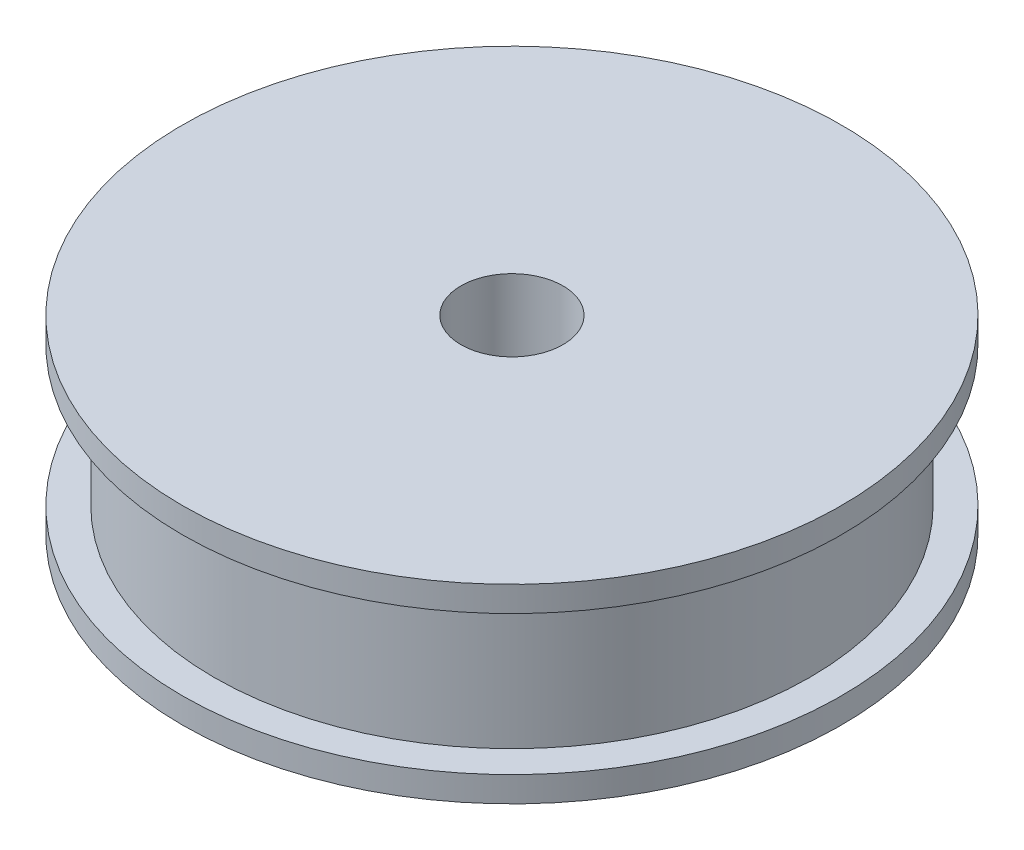
ISO-10303-21;
HEADER;
FILE_DESCRIPTION(('STEP AP214'),'2;1');
FILE_NAME('part.step','',(''),(''),'','','');
FILE_SCHEMA(('AUTOMOTIVE_DESIGN { 1 0 10303 214 1 1 1 1 }'));
ENDSEC;
DATA;
#1=APPLICATION_CONTEXT('core data for automotive mechanical design processes');
#2=APPLICATION_PROTOCOL_DEFINITION('international standard','automotive_design',2000,#1);
#3=PRODUCT_CONTEXT('',#1,'mechanical');
#4=PRODUCT('Part','Part','',(#3));
#5=PRODUCT_RELATED_PRODUCT_CATEGORY('part','',(#4));
#6=PRODUCT_DEFINITION_FORMATION('','',#4);
#7=PRODUCT_DEFINITION_CONTEXT('part definition',#1,'design');
#8=PRODUCT_DEFINITION('design','',#6,#7);
#9=PRODUCT_DEFINITION_SHAPE('','',#8);
#10=(LENGTH_UNIT() NAMED_UNIT(*) SI_UNIT(.MILLI.,.METRE.));
#11=(NAMED_UNIT(*) PLANE_ANGLE_UNIT() SI_UNIT($,.RADIAN.));
#12=(NAMED_UNIT(*) SI_UNIT($,.STERADIAN.) SOLID_ANGLE_UNIT());
#13=UNCERTAINTY_MEASURE_WITH_UNIT(LENGTH_MEASURE(1.E-05),#10,'distance_accuracy_value','');
#14=(GEOMETRIC_REPRESENTATION_CONTEXT(3) GLOBAL_UNCERTAINTY_ASSIGNED_CONTEXT((#13)) GLOBAL_UNIT_ASSIGNED_CONTEXT((#10,
#11,#12)) REPRESENTATION_CONTEXT('',''));
#15=CARTESIAN_POINT('',(0.,0.,0.));
#16=DIRECTION('',(0.,0.,1.));
#17=DIRECTION('',(1.,0.,0.));
#18=AXIS2_PLACEMENT_3D('',#15,#16,#17);
#19=CARTESIAN_POINT('',(0.,2.,0.));
#20=DIRECTION('',(0.,-1.,0.));
#21=DIRECTION('',(0.,0.,-1.));
#22=AXIS2_PLACEMENT_3D('',#19,#20,#21);
#23=CYLINDRICAL_SURFACE('',#22,26.);
#24=CARTESIAN_POINT('',(0.,2.,0.));
#25=DIRECTION('',(0.,1.,0.));
#26=DIRECTION('',(0.,0.,1.));
#27=AXIS2_PLACEMENT_3D('',#24,#25,#26);
#28=CIRCLE('',#27,26.);
#29=CARTESIAN_POINT('',(0.,2.,26.));
#30=VERTEX_POINT('',#29);
#31=EDGE_CURVE('E47',#30,#30,#28,.T.);
#32=ORIENTED_EDGE('',*,*,#31,.F.);
#33=EDGE_LOOP('',(#32));
#34=FACE_BOUND('',#33,.T.);
#35=CARTESIAN_POINT('',(0.,0.,0.));
#36=DIRECTION('',(0.,1.,0.));
#37=DIRECTION('',(0.,0.,1.));
#38=AXIS2_PLACEMENT_3D('',#35,#36,#37);
#39=CIRCLE('',#38,26.);
#40=CARTESIAN_POINT('',(0.,0.,26.));
#41=VERTEX_POINT('',#40);
#42=EDGE_CURVE('E42',#41,#41,#39,.T.);
#43=ORIENTED_EDGE('',*,*,#42,.T.);
#44=EDGE_LOOP('',(#43));
#45=FACE_BOUND('',#44,.T.);
#46=ADVANCED_FACE('F39',(#34,#45),#23,.T.);
#47=CARTESIAN_POINT('',(0.,2.,0.));
#48=DIRECTION('',(0.,1.,0.));
#49=DIRECTION('',(0.,0.,1.));
#50=AXIS2_PLACEMENT_3D('',#47,#48,#49);
#51=PLANE('',#50);
#52=CARTESIAN_POINT('',(0.,2.,0.));
#53=DIRECTION('',(0.,1.,0.));
#54=DIRECTION('',(0.,0.,1.));
#55=AXIS2_PLACEMENT_3D('',#52,#53,#54);
#56=CIRCLE('',#55,23.495);
#57=CARTESIAN_POINT('',(0.,2.,23.495));
#58=VERTEX_POINT('',#57);
#59=EDGE_CURVE('E10',#58,#58,#56,.T.);
#60=ORIENTED_EDGE('',*,*,#59,.F.);
#61=EDGE_LOOP('',(#60));
#62=FACE_BOUND('',#61,.T.);
#63=ORIENTED_EDGE('',*,*,#31,.T.);
#64=EDGE_LOOP('',(#63));
#65=FACE_BOUND('',#64,.T.);
#66=ADVANCED_FACE('F104',(#62,#65),#51,.T.);
#67=CARTESIAN_POINT('',(0.,0.,0.));
#68=DIRECTION('',(0.,1.,0.));
#69=DIRECTION('',(0.,0.,1.));
#70=AXIS2_PLACEMENT_3D('',#67,#68,#69);
#71=PLANE('',#70);
#72=CARTESIAN_POINT('',(0.,0.,0.));
#73=DIRECTION('',(0.,1.,0.));
#74=DIRECTION('',(0.,0.,1.));
#75=AXIS2_PLACEMENT_3D('',#72,#73,#74);
#76=CIRCLE('',#75,4.025);
#77=CARTESIAN_POINT('',(0.,0.,4.025));
#78=VERTEX_POINT('',#77);
#79=EDGE_CURVE('E63',#78,#78,#76,.T.);
#80=ORIENTED_EDGE('',*,*,#79,.T.);
#81=EDGE_LOOP('',(#80));
#82=FACE_BOUND('',#81,.T.);
#83=ORIENTED_EDGE('',*,*,#42,.F.);
#84=EDGE_LOOP('',(#83));
#85=FACE_BOUND('',#84,.T.);
#86=ADVANCED_FACE('F75',(#82,#85),#71,.F.);
#87=CARTESIAN_POINT('',(0.,13.,0.));
#88=DIRECTION('',(0.,-1.,0.));
#89=DIRECTION('',(0.,0.,-1.));
#90=AXIS2_PLACEMENT_3D('',#87,#88,#89);
#91=CYLINDRICAL_SURFACE('',#90,23.495);
#92=CARTESIAN_POINT('',(0.,13.,0.));
#93=DIRECTION('',(0.,1.,0.));
#94=DIRECTION('',(0.,0.,1.));
#95=AXIS2_PLACEMENT_3D('',#92,#93,#94);
#96=CIRCLE('',#95,23.495);
#97=CARTESIAN_POINT('',(0.,13.,23.495));
#98=VERTEX_POINT('',#97);
#99=EDGE_CURVE('E54',#98,#98,#96,.T.);
#100=ORIENTED_EDGE('',*,*,#99,.F.);
#101=EDGE_LOOP('',(#100));
#102=FACE_BOUND('',#101,.T.);
#103=ORIENTED_EDGE('',*,*,#59,.T.);
#104=EDGE_LOOP('',(#103));
#105=FACE_BOUND('',#104,.T.);
#106=ADVANCED_FACE('F94',(#102,#105),#91,.T.);
#107=CARTESIAN_POINT('',(0.,15.,0.));
#108=DIRECTION('',(0.,-1.,0.));
#109=DIRECTION('',(0.,0.,-1.));
#110=AXIS2_PLACEMENT_3D('',#107,#108,#109);
#111=CYLINDRICAL_SURFACE('',#110,26.);
#112=CARTESIAN_POINT('',(0.,15.,0.));
#113=DIRECTION('',(0.,1.,0.));
#114=DIRECTION('',(0.,0.,1.));
#115=AXIS2_PLACEMENT_3D('',#112,#113,#114);
#116=CIRCLE('',#115,26.);
#117=CARTESIAN_POINT('',(0.,15.,26.));
#118=VERTEX_POINT('',#117);
#119=EDGE_CURVE('E58',#118,#118,#116,.T.);
#120=ORIENTED_EDGE('',*,*,#119,.F.);
#121=EDGE_LOOP('',(#120));
#122=FACE_BOUND('',#121,.T.);
#123=CARTESIAN_POINT('',(0.,13.,0.));
#124=DIRECTION('',(0.,1.,0.));
#125=DIRECTION('',(0.,0.,1.));
#126=AXIS2_PLACEMENT_3D('',#123,#124,#125);
#127=CIRCLE('',#126,26.);
#128=CARTESIAN_POINT('',(0.,13.,26.));
#129=VERTEX_POINT('',#128);
#130=EDGE_CURVE('E59',#129,#129,#127,.T.);
#131=ORIENTED_EDGE('',*,*,#130,.T.);
#132=EDGE_LOOP('',(#131));
#133=FACE_BOUND('',#132,.T.);
#134=ADVANCED_FACE('F88',(#122,#133),#111,.T.);
#135=CARTESIAN_POINT('',(0.,15.,0.));
#136=DIRECTION('',(0.,1.,0.));
#137=DIRECTION('',(0.,0.,1.));
#138=AXIS2_PLACEMENT_3D('',#135,#136,#137);
#139=PLANE('',#138);
#140=CARTESIAN_POINT('',(0.,15.,0.));
#141=DIRECTION('',(0.,1.,0.));
#142=DIRECTION('',(0.,0.,1.));
#143=AXIS2_PLACEMENT_3D('',#140,#141,#142);
#144=CIRCLE('',#143,4.025);
#145=CARTESIAN_POINT('',(0.,15.,4.025));
#146=VERTEX_POINT('',#145);
#147=EDGE_CURVE('E67',#146,#146,#144,.T.);
#148=ORIENTED_EDGE('',*,*,#147,.F.);
#149=EDGE_LOOP('',(#148));
#150=FACE_BOUND('',#149,.T.);
#151=ORIENTED_EDGE('',*,*,#119,.T.);
#152=EDGE_LOOP('',(#151));
#153=FACE_BOUND('',#152,.T.);
#154=ADVANCED_FACE('F85',(#150,#153),#139,.T.);
#155=CARTESIAN_POINT('',(0.,13.,0.));
#156=DIRECTION('',(0.,1.,0.));
#157=DIRECTION('',(0.,0.,1.));
#158=AXIS2_PLACEMENT_3D('',#155,#156,#157);
#159=PLANE('',#158);
#160=ORIENTED_EDGE('',*,*,#99,.T.);
#161=EDGE_LOOP('',(#160));
#162=FACE_BOUND('',#161,.T.);
#163=ORIENTED_EDGE('',*,*,#130,.F.);
#164=EDGE_LOOP('',(#163));
#165=FACE_BOUND('',#164,.T.);
#166=ADVANCED_FACE('F81',(#162,#165),#159,.F.);
#167=CARTESIAN_POINT('',(0.,0.,0.));
#168=DIRECTION('',(0.,1.,0.));
#169=DIRECTION('',(0.,0.,1.));
#170=AXIS2_PLACEMENT_3D('',#167,#168,#169);
#171=CYLINDRICAL_SURFACE('',#170,4.025);
#172=ORIENTED_EDGE('',*,*,#79,.F.);
#173=EDGE_LOOP('',(#172));
#174=FACE_BOUND('',#173,.T.);
#175=ORIENTED_EDGE('',*,*,#147,.T.);
#176=EDGE_LOOP('',(#175));
#177=FACE_BOUND('',#176,.T.);
#178=ADVANCED_FACE('F78',(#174,#177),#171,.F.);
#179=CLOSED_SHELL('',(#46,#66,#86,#106,#134,#154,#166,#178));
#180=MANIFOLD_SOLID_BREP('B2',#179);
#181=ADVANCED_BREP_SHAPE_REPRESENTATION('',(#18,#180),#14);
#182=SHAPE_DEFINITION_REPRESENTATION(#9,#181);
ENDSEC;
END-ISO-10303-21;
